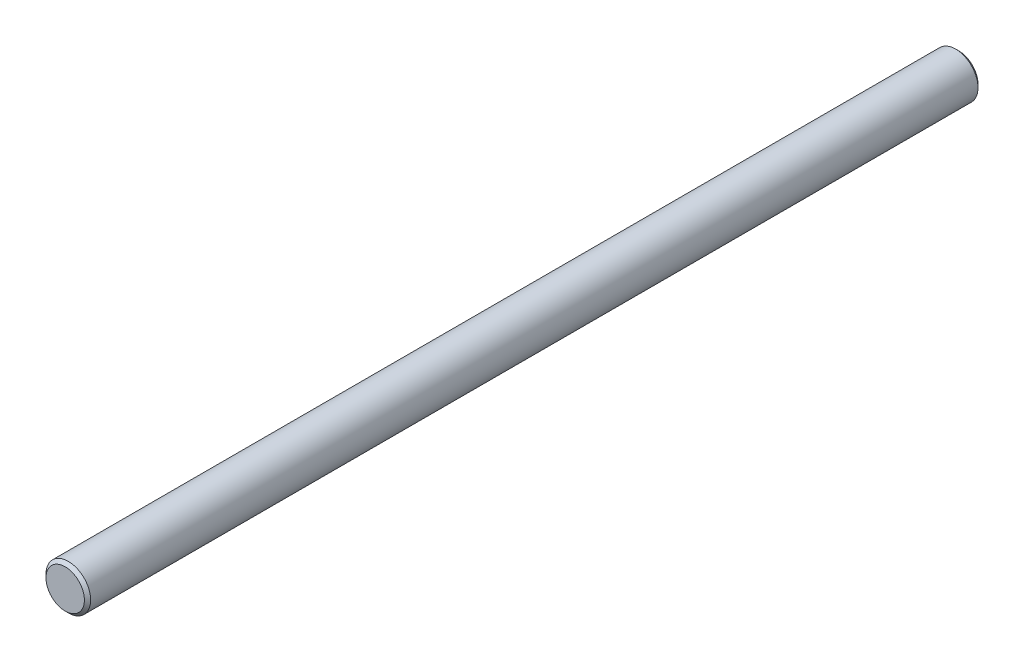
ISO-10303-21;
HEADER;
FILE_DESCRIPTION(('STEP AP214'),'2;1');
FILE_NAME('part.step','',(''),(''),'','','');
FILE_SCHEMA(('AUTOMOTIVE_DESIGN { 1 0 10303 214 1 1 1 1 }'));
ENDSEC;
DATA;
#1=APPLICATION_CONTEXT('core data for automotive mechanical design processes');
#2=APPLICATION_PROTOCOL_DEFINITION('international standard','automotive_design',2000,#1);
#3=PRODUCT_CONTEXT('',#1,'mechanical');
#4=PRODUCT('Part','Part','',(#3));
#5=PRODUCT_RELATED_PRODUCT_CATEGORY('part','',(#4));
#6=PRODUCT_DEFINITION_FORMATION('','',#4);
#7=PRODUCT_DEFINITION_CONTEXT('part definition',#1,'design');
#8=PRODUCT_DEFINITION('design','',#6,#7);
#9=PRODUCT_DEFINITION_SHAPE('','',#8);
#10=(LENGTH_UNIT() NAMED_UNIT(*) SI_UNIT(.MILLI.,.METRE.));
#11=(NAMED_UNIT(*) PLANE_ANGLE_UNIT() SI_UNIT($,.RADIAN.));
#12=(NAMED_UNIT(*) SI_UNIT($,.STERADIAN.) SOLID_ANGLE_UNIT());
#13=UNCERTAINTY_MEASURE_WITH_UNIT(LENGTH_MEASURE(1.E-05),#10,'distance_accuracy_value','');
#14=(GEOMETRIC_REPRESENTATION_CONTEXT(3) GLOBAL_UNCERTAINTY_ASSIGNED_CONTEXT((#13)) GLOBAL_UNIT_ASSIGNED_CONTEXT((#10,
#11,#12)) REPRESENTATION_CONTEXT('',''));
#15=CARTESIAN_POINT('',(0.,0.,0.));
#16=DIRECTION('',(0.,0.,1.));
#17=DIRECTION('',(1.,0.,0.));
#18=AXIS2_PLACEMENT_3D('',#15,#16,#17);
#19=CARTESIAN_POINT('',(0.,0.,300.));
#20=DIRECTION('',(0.,0.,-1.));
#21=DIRECTION('',(-1.,0.,0.));
#22=AXIS2_PLACEMENT_3D('',#19,#20,#21);
#23=CYLINDRICAL_SURFACE('',#22,15.);
#24=CARTESIAN_POINT('',(0.,0.,-297.9));
#25=DIRECTION('',(0.,0.,1.));
#26=DIRECTION('',(1.,0.,0.));
#27=AXIS2_PLACEMENT_3D('',#24,#25,#26);
#28=CIRCLE('',#27,15.);
#29=CARTESIAN_POINT('',(15.,0.,-297.9));
#30=VERTEX_POINT('',#29);
#31=EDGE_CURVE('E41',#30,#30,#28,.T.);
#32=ORIENTED_EDGE('',*,*,#31,.T.);
#33=EDGE_LOOP('',(#32));
#34=FACE_BOUND('',#33,.T.);
#35=CARTESIAN_POINT('',(0.,0.,297.9));
#36=DIRECTION('',(0.,0.,1.));
#37=DIRECTION('',(1.,0.,0.));
#38=AXIS2_PLACEMENT_3D('',#35,#36,#37);
#39=CIRCLE('',#38,15.);
#40=CARTESIAN_POINT('',(15.,0.,297.9));
#41=VERTEX_POINT('',#40);
#42=EDGE_CURVE('E45',#41,#41,#39,.F.);
#43=ORIENTED_EDGE('',*,*,#42,.T.);
#44=EDGE_LOOP('',(#43));
#45=FACE_BOUND('',#44,.T.);
#46=ADVANCED_FACE('F30',(#34,#45),#23,.T.);
#47=CARTESIAN_POINT('',(0.,0.,300.));
#48=DIRECTION('',(0.,0.,1.));
#49=DIRECTION('',(1.,0.,0.));
#50=AXIS2_PLACEMENT_3D('',#47,#48,#49);
#51=PLANE('',#50);
#52=CARTESIAN_POINT('',(0.,0.,300.));
#53=DIRECTION('',(0.,0.,1.));
#54=DIRECTION('',(1.,0.,0.));
#55=AXIS2_PLACEMENT_3D('',#52,#53,#54);
#56=CIRCLE('',#55,12.9);
#57=CARTESIAN_POINT('',(12.9,0.,300.));
#58=VERTEX_POINT('',#57);
#59=EDGE_CURVE('E10',#58,#58,#56,.T.);
#60=ORIENTED_EDGE('',*,*,#59,.T.);
#61=EDGE_LOOP('',(#60));
#62=FACE_BOUND('',#61,.T.);
#63=ADVANCED_FACE('F61',(#62),#51,.T.);
#64=CARTESIAN_POINT('',(0.,0.,-300.));
#65=DIRECTION('',(0.,0.,1.));
#66=DIRECTION('',(1.,0.,0.));
#67=AXIS2_PLACEMENT_3D('',#64,#65,#66);
#68=PLANE('',#67);
#69=CARTESIAN_POINT('',(0.,0.,-300.));
#70=DIRECTION('',(0.,0.,1.));
#71=DIRECTION('',(1.,0.,0.));
#72=AXIS2_PLACEMENT_3D('',#69,#70,#71);
#73=CIRCLE('',#72,12.9000000000002);
#74=CARTESIAN_POINT('',(12.9000000000002,0.,-300.));
#75=VERTEX_POINT('',#74);
#76=EDGE_CURVE('E37',#75,#75,#73,.F.);
#77=ORIENTED_EDGE('',*,*,#76,.T.);
#78=EDGE_LOOP('',(#77));
#79=FACE_BOUND('',#78,.T.);
#80=ADVANCED_FACE('F58',(#79),#68,.F.);
#81=CARTESIAN_POINT('',(0.,0.,-297.9));
#82=DIRECTION('',(0.,0.,1.));
#83=DIRECTION('',(1.,0.,0.));
#84=AXIS2_PLACEMENT_3D('',#81,#82,#83);
#85=CONICAL_SURFACE('',#84,15.,0.785398163397459);
#86=ORIENTED_EDGE('',*,*,#76,.F.);
#87=EDGE_LOOP('',(#86));
#88=FACE_BOUND('',#87,.T.);
#89=ORIENTED_EDGE('',*,*,#31,.F.);
#90=EDGE_LOOP('',(#89));
#91=FACE_BOUND('',#90,.T.);
#92=ADVANCED_FACE('F54',(#88,#91),#85,.T.);
#93=CARTESIAN_POINT('',(0.,0.,300.));
#94=DIRECTION('',(0.,0.,-1.));
#95=DIRECTION('',(-1.,0.,0.));
#96=AXIS2_PLACEMENT_3D('',#93,#94,#95);
#97=CONICAL_SURFACE('',#96,12.9,0.785398163397445);
#98=ORIENTED_EDGE('',*,*,#42,.F.);
#99=EDGE_LOOP('',(#98));
#100=FACE_BOUND('',#99,.T.);
#101=ORIENTED_EDGE('',*,*,#59,.F.);
#102=EDGE_LOOP('',(#101));
#103=FACE_BOUND('',#102,.T.);
#104=ADVANCED_FACE('F32',(#100,#103),#97,.T.);
#105=CLOSED_SHELL('',(#46,#63,#80,#92,#104));
#106=MANIFOLD_SOLID_BREP('B2',#105);
#107=ADVANCED_BREP_SHAPE_REPRESENTATION('',(#18,#106),#14);
#108=SHAPE_DEFINITION_REPRESENTATION(#9,#107);
ENDSEC;
END-ISO-10303-21;
